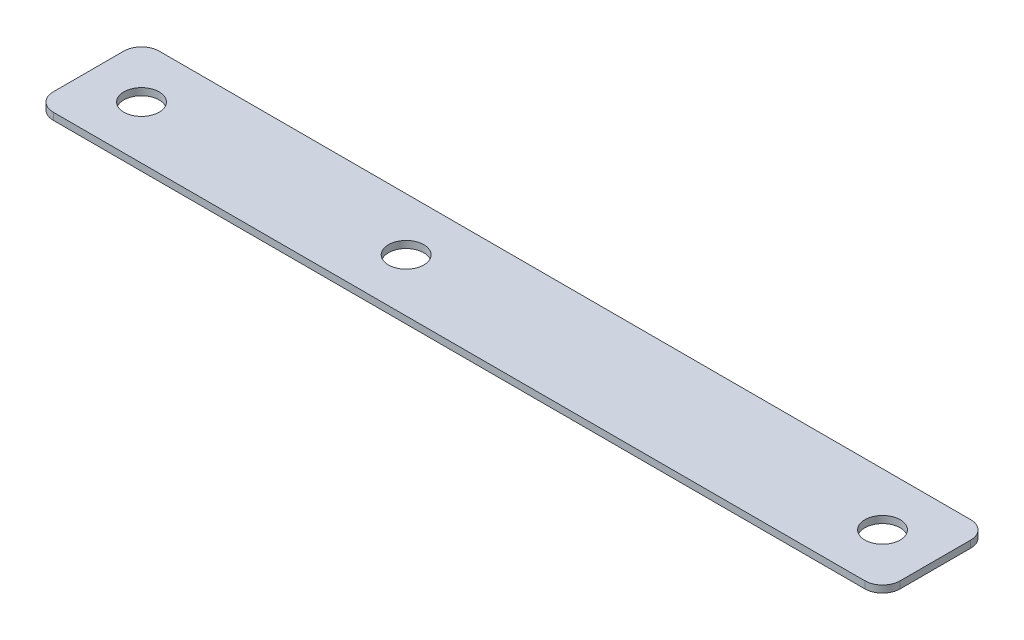
ISO-10303-21;
HEADER;
FILE_DESCRIPTION(('STEP AP214'),'2;1');
FILE_NAME('part.step','',(''),(''),'','','');
FILE_SCHEMA(('AUTOMOTIVE_DESIGN { 1 0 10303 214 1 1 1 1 }'));
ENDSEC;
DATA;
#1=APPLICATION_CONTEXT('core data for automotive mechanical design processes');
#2=APPLICATION_PROTOCOL_DEFINITION('international standard','automotive_design',2000,#1);
#3=PRODUCT_CONTEXT('',#1,'mechanical');
#4=PRODUCT('Part','Part','',(#3));
#5=PRODUCT_RELATED_PRODUCT_CATEGORY('part','',(#4));
#6=PRODUCT_DEFINITION_FORMATION('','',#4);
#7=PRODUCT_DEFINITION_CONTEXT('part definition',#1,'design');
#8=PRODUCT_DEFINITION('design','',#6,#7);
#9=PRODUCT_DEFINITION_SHAPE('','',#8);
#10=(LENGTH_UNIT() NAMED_UNIT(*) SI_UNIT(.MILLI.,.METRE.));
#11=(NAMED_UNIT(*) PLANE_ANGLE_UNIT() SI_UNIT($,.RADIAN.));
#12=(NAMED_UNIT(*) SI_UNIT($,.STERADIAN.) SOLID_ANGLE_UNIT());
#13=UNCERTAINTY_MEASURE_WITH_UNIT(LENGTH_MEASURE(1.E-05),#10,'distance_accuracy_value','');
#14=(GEOMETRIC_REPRESENTATION_CONTEXT(3) GLOBAL_UNCERTAINTY_ASSIGNED_CONTEXT((#13)) GLOBAL_UNIT_ASSIGNED_CONTEXT((#10,
#11,#12)) REPRESENTATION_CONTEXT('',''));
#15=CARTESIAN_POINT('',(0.,0.,0.));
#16=DIRECTION('',(0.,0.,1.));
#17=DIRECTION('',(1.,0.,0.));
#18=AXIS2_PLACEMENT_3D('',#15,#16,#17);
#19=CARTESIAN_POINT('',(298.45,2.54,-6.35));
#20=DIRECTION('',(0.,1.,0.));
#21=DIRECTION('',(0.,0.,1.));
#22=AXIS2_PLACEMENT_3D('',#19,#20,#21);
#23=PLANE('',#22);
#24=CARTESIAN_POINT('',(285.75,2.54,-19.05));
#25=DIRECTION('',(0.,1.,0.));
#26=DIRECTION('',(0.,0.,-1.));
#27=AXIS2_PLACEMENT_3D('',#24,#25,#26);
#28=CIRCLE('',#27,6.35);
#29=CARTESIAN_POINT('',(285.75,2.54,-25.4));
#30=VERTEX_POINT('',#29);
#31=EDGE_CURVE('E182',#30,#30,#28,.T.);
#32=ORIENTED_EDGE('',*,*,#31,.F.);
#33=EDGE_LOOP('',(#32));
#34=FACE_BOUND('',#33,.T.);
#35=CARTESIAN_POINT('',(298.45,2.54,-6.35));
#36=DIRECTION('',(0.,1.,0.));
#37=DIRECTION('',(0.,0.,1.));
#38=AXIS2_PLACEMENT_3D('',#35,#36,#37);
#39=CIRCLE('',#38,6.35000000000001);
#40=CARTESIAN_POINT('',(298.45,2.54,0.));
#41=VERTEX_POINT('',#40);
#42=CARTESIAN_POINT('',(304.8,2.54,-6.35000000000004));
#43=VERTEX_POINT('',#42);
#44=EDGE_CURVE('E145',#41,#43,#39,.T.);
#45=ORIENTED_EDGE('',*,*,#44,.T.);
#46=DIRECTION('',(0.,0.,-1.));
#47=VECTOR('',#46,1.);
#48=CARTESIAN_POINT('',(304.8,2.54,-6.35000000000004));
#49=LINE('',#48,#47);
#50=CARTESIAN_POINT('',(304.8,2.54,-31.75));
#51=VERTEX_POINT('',#50);
#52=EDGE_CURVE('E93',#43,#51,#49,.T.);
#53=ORIENTED_EDGE('',*,*,#52,.T.);
#54=CARTESIAN_POINT('',(298.45,2.54,-31.75));
#55=DIRECTION('',(0.,1.,0.));
#56=DIRECTION('',(0.,0.,-1.));
#57=AXIS2_PLACEMENT_3D('',#54,#55,#56);
#58=CIRCLE('',#57,6.35000000000001);
#59=CARTESIAN_POINT('',(298.45,2.54,-38.1));
#60=VERTEX_POINT('',#59);
#61=EDGE_CURVE('E160',#51,#60,#58,.T.);
#62=ORIENTED_EDGE('',*,*,#61,.T.);
#63=DIRECTION('',(-1.,0.,0.));
#64=VECTOR('',#63,1.);
#65=CARTESIAN_POINT('',(6.35000000000004,2.54,-38.1));
#66=LINE('',#65,#64);
#67=CARTESIAN_POINT('',(6.35,2.54,-38.1));
#68=VERTEX_POINT('',#67);
#69=EDGE_CURVE('E173',#60,#68,#66,.T.);
#70=ORIENTED_EDGE('',*,*,#69,.T.);
#71=CARTESIAN_POINT('',(6.35,2.54,-31.75));
#72=DIRECTION('',(0.,1.,0.));
#73=DIRECTION('',(0.,0.,-1.));
#74=AXIS2_PLACEMENT_3D('',#71,#72,#73);
#75=CIRCLE('',#74,6.35);
#76=CARTESIAN_POINT('',(0.,2.54,-31.75));
#77=VERTEX_POINT('',#76);
#78=EDGE_CURVE('E112',#68,#77,#75,.T.);
#79=ORIENTED_EDGE('',*,*,#78,.T.);
#80=DIRECTION('',(0.,0.,1.));
#81=VECTOR('',#80,1.);
#82=CARTESIAN_POINT('',(0.,2.54,-6.35000000000004));
#83=LINE('',#82,#81);
#84=CARTESIAN_POINT('',(0.,2.54,-6.35000000000004));
#85=VERTEX_POINT('',#84);
#86=EDGE_CURVE('E106',#77,#85,#83,.T.);
#87=ORIENTED_EDGE('',*,*,#86,.T.);
#88=CARTESIAN_POINT('',(6.35,2.54,-6.35));
#89=DIRECTION('',(0.,1.,0.));
#90=DIRECTION('',(0.,0.,-1.));
#91=AXIS2_PLACEMENT_3D('',#88,#89,#90);
#92=CIRCLE('',#91,6.35);
#93=CARTESIAN_POINT('',(6.35000000000004,2.54,0.));
#94=VERTEX_POINT('',#93);
#95=EDGE_CURVE('E110',#85,#94,#92,.T.);
#96=ORIENTED_EDGE('',*,*,#95,.T.);
#97=DIRECTION('',(1.,0.,0.));
#98=VECTOR('',#97,1.);
#99=CARTESIAN_POINT('',(6.35000000000004,2.54,0.));
#100=LINE('',#99,#98);
#101=EDGE_CURVE('E50',#94,#41,#100,.T.);
#102=ORIENTED_EDGE('',*,*,#101,.T.);
#103=EDGE_LOOP('',(#45,#53,#62,#70,#79,#87,#96,#102));
#104=FACE_BOUND('',#103,.T.);
#105=CARTESIAN_POINT('',(19.05,2.54,-19.05));
#106=DIRECTION('',(0.,1.,0.));
#107=DIRECTION('',(0.,0.,1.));
#108=AXIS2_PLACEMENT_3D('',#105,#106,#107);
#109=CIRCLE('',#108,6.35);
#110=CARTESIAN_POINT('',(19.05,2.54,-12.7));
#111=VERTEX_POINT('',#110);
#112=EDGE_CURVE('E134',#111,#111,#109,.T.);
#113=ORIENTED_EDGE('',*,*,#112,.F.);
#114=EDGE_LOOP('',(#113));
#115=FACE_BOUND('',#114,.T.);
#116=CARTESIAN_POINT('',(114.3,2.54,-19.05));
#117=DIRECTION('',(0.,1.,0.));
#118=DIRECTION('',(0.,0.,1.));
#119=AXIS2_PLACEMENT_3D('',#116,#117,#118);
#120=CIRCLE('',#119,6.35);
#121=CARTESIAN_POINT('',(114.3,2.54,-12.7));
#122=VERTEX_POINT('',#121);
#123=EDGE_CURVE('E188',#122,#122,#120,.T.);
#124=ORIENTED_EDGE('',*,*,#123,.F.);
#125=EDGE_LOOP('',(#124));
#126=FACE_BOUND('',#125,.T.);
#127=ADVANCED_FACE('F33',(#34,#104,#115,#126),#23,.T.);
#128=CARTESIAN_POINT('',(298.45,0.,-6.35));
#129=DIRECTION('',(0.,1.,0.));
#130=DIRECTION('',(0.,0.,1.));
#131=AXIS2_PLACEMENT_3D('',#128,#129,#130);
#132=PLANE('',#131);
#133=CARTESIAN_POINT('',(298.45,0.,-6.35));
#134=DIRECTION('',(0.,1.,0.));
#135=DIRECTION('',(0.,0.,1.));
#136=AXIS2_PLACEMENT_3D('',#133,#134,#135);
#137=CIRCLE('',#136,6.35000000000001);
#138=CARTESIAN_POINT('',(298.45,0.,0.));
#139=VERTEX_POINT('',#138);
#140=CARTESIAN_POINT('',(304.8,0.,-6.35000000000004));
#141=VERTEX_POINT('',#140);
#142=EDGE_CURVE('E130',#139,#141,#137,.T.);
#143=ORIENTED_EDGE('',*,*,#142,.F.);
#144=DIRECTION('',(1.,0.,0.));
#145=VECTOR('',#144,1.);
#146=CARTESIAN_POINT('',(6.35000000000004,0.,0.));
#147=LINE('',#146,#145);
#148=CARTESIAN_POINT('',(6.35000000000004,0.,0.));
#149=VERTEX_POINT('',#148);
#150=EDGE_CURVE('E85',#149,#139,#147,.T.);
#151=ORIENTED_EDGE('',*,*,#150,.F.);
#152=CARTESIAN_POINT('',(6.35,0.,-6.35));
#153=DIRECTION('',(0.,1.,0.));
#154=DIRECTION('',(0.,0.,-1.));
#155=AXIS2_PLACEMENT_3D('',#152,#153,#154);
#156=CIRCLE('',#155,6.35);
#157=CARTESIAN_POINT('',(0.,0.,-6.35000000000004));
#158=VERTEX_POINT('',#157);
#159=EDGE_CURVE('E79',#158,#149,#156,.T.);
#160=ORIENTED_EDGE('',*,*,#159,.F.);
#161=DIRECTION('',(0.,0.,1.));
#162=VECTOR('',#161,1.);
#163=CARTESIAN_POINT('',(0.,0.,-6.35000000000004));
#164=LINE('',#163,#162);
#165=CARTESIAN_POINT('',(0.,0.,-31.75));
#166=VERTEX_POINT('',#165);
#167=EDGE_CURVE('E120',#166,#158,#164,.T.);
#168=ORIENTED_EDGE('',*,*,#167,.F.);
#169=CARTESIAN_POINT('',(6.35,0.,-31.75));
#170=DIRECTION('',(0.,1.,0.));
#171=DIRECTION('',(0.,0.,-1.));
#172=AXIS2_PLACEMENT_3D('',#169,#170,#171);
#173=CIRCLE('',#172,6.35);
#174=CARTESIAN_POINT('',(6.35,0.,-38.1));
#175=VERTEX_POINT('',#174);
#176=EDGE_CURVE('E140',#175,#166,#173,.T.);
#177=ORIENTED_EDGE('',*,*,#176,.F.);
#178=DIRECTION('',(-1.,0.,0.));
#179=VECTOR('',#178,1.);
#180=CARTESIAN_POINT('',(6.35000000000004,0.,-38.1));
#181=LINE('',#180,#179);
#182=CARTESIAN_POINT('',(298.45,0.,-38.1));
#183=VERTEX_POINT('',#182);
#184=EDGE_CURVE('E138',#183,#175,#181,.T.);
#185=ORIENTED_EDGE('',*,*,#184,.F.);
#186=CARTESIAN_POINT('',(298.45,0.,-31.75));
#187=DIRECTION('',(0.,1.,0.));
#188=DIRECTION('',(0.,0.,-1.));
#189=AXIS2_PLACEMENT_3D('',#186,#187,#188);
#190=CIRCLE('',#189,6.35000000000001);
#191=CARTESIAN_POINT('',(304.8,0.,-31.75));
#192=VERTEX_POINT('',#191);
#193=EDGE_CURVE('E136',#192,#183,#190,.T.);
#194=ORIENTED_EDGE('',*,*,#193,.F.);
#195=DIRECTION('',(0.,0.,-1.));
#196=VECTOR('',#195,1.);
#197=CARTESIAN_POINT('',(304.8,0.,-6.35000000000004));
#198=LINE('',#197,#196);
#199=EDGE_CURVE('E133',#141,#192,#198,.T.);
#200=ORIENTED_EDGE('',*,*,#199,.F.);
#201=EDGE_LOOP('',(#143,#151,#160,#168,#177,#185,#194,#200));
#202=FACE_BOUND('',#201,.T.);
#203=CARTESIAN_POINT('',(19.05,0.,-19.05));
#204=DIRECTION('',(0.,1.,0.));
#205=DIRECTION('',(0.,0.,1.));
#206=AXIS2_PLACEMENT_3D('',#203,#204,#205);
#207=CIRCLE('',#206,6.35);
#208=CARTESIAN_POINT('',(19.05,0.,-12.7));
#209=VERTEX_POINT('',#208);
#210=EDGE_CURVE('E179',#209,#209,#207,.T.);
#211=ORIENTED_EDGE('',*,*,#210,.T.);
#212=EDGE_LOOP('',(#211));
#213=FACE_BOUND('',#212,.T.);
#214=CARTESIAN_POINT('',(285.75,0.,-19.05));
#215=DIRECTION('',(0.,1.,0.));
#216=DIRECTION('',(0.,0.,-1.));
#217=AXIS2_PLACEMENT_3D('',#214,#215,#216);
#218=CIRCLE('',#217,6.35);
#219=CARTESIAN_POINT('',(285.75,0.,-25.4));
#220=VERTEX_POINT('',#219);
#221=EDGE_CURVE('E185',#220,#220,#218,.T.);
#222=ORIENTED_EDGE('',*,*,#221,.T.);
#223=EDGE_LOOP('',(#222));
#224=FACE_BOUND('',#223,.T.);
#225=CARTESIAN_POINT('',(114.3,0.,-19.05));
#226=DIRECTION('',(0.,1.,0.));
#227=DIRECTION('',(0.,0.,1.));
#228=AXIS2_PLACEMENT_3D('',#225,#226,#227);
#229=CIRCLE('',#228,6.35);
#230=CARTESIAN_POINT('',(114.3,0.,-12.7));
#231=VERTEX_POINT('',#230);
#232=EDGE_CURVE('E191',#231,#231,#229,.T.);
#233=ORIENTED_EDGE('',*,*,#232,.T.);
#234=EDGE_LOOP('',(#233));
#235=FACE_BOUND('',#234,.T.);
#236=ADVANCED_FACE('F164',(#202,#213,#224,#235),#132,.F.);
#237=CARTESIAN_POINT('',(298.45,2.54,-6.35));
#238=DIRECTION('',(0.,-1.,0.));
#239=DIRECTION('',(0.,0.,-1.));
#240=AXIS2_PLACEMENT_3D('',#237,#238,#239);
#241=CYLINDRICAL_SURFACE('',#240,6.35000000000001);
#242=ORIENTED_EDGE('',*,*,#142,.T.);
#243=DIRECTION('',(0.,-1.,0.));
#244=VECTOR('',#243,1.);
#245=CARTESIAN_POINT('',(304.8,2.54,-6.35000000000004));
#246=LINE('',#245,#244);
#247=EDGE_CURVE('E11',#43,#141,#246,.T.);
#248=ORIENTED_EDGE('',*,*,#247,.F.);
#249=ORIENTED_EDGE('',*,*,#44,.F.);
#250=DIRECTION('',(0.,-1.,0.));
#251=VECTOR('',#250,1.);
#252=CARTESIAN_POINT('',(298.45,2.54,0.));
#253=LINE('',#252,#251);
#254=EDGE_CURVE('E126',#41,#139,#253,.T.);
#255=ORIENTED_EDGE('',*,*,#254,.T.);
#256=EDGE_LOOP('',(#242,#248,#249,#255));
#257=FACE_BOUND('',#256,.T.);
#258=ADVANCED_FACE('F35',(#257),#241,.T.);
#259=CARTESIAN_POINT('',(304.8,2.54,-6.35000000000004));
#260=DIRECTION('',(-1.,0.,0.));
#261=DIRECTION('',(0.,0.,1.));
#262=AXIS2_PLACEMENT_3D('',#259,#260,#261);
#263=PLANE('',#262);
#264=ORIENTED_EDGE('',*,*,#199,.T.);
#265=DIRECTION('',(0.,-1.,0.));
#266=VECTOR('',#265,1.);
#267=CARTESIAN_POINT('',(304.8,2.54,-31.75));
#268=LINE('',#267,#266);
#269=EDGE_CURVE('E42',#51,#192,#268,.T.);
#270=ORIENTED_EDGE('',*,*,#269,.F.);
#271=ORIENTED_EDGE('',*,*,#52,.F.);
#272=ORIENTED_EDGE('',*,*,#247,.T.);
#273=EDGE_LOOP('',(#264,#270,#271,#272));
#274=FACE_BOUND('',#273,.T.);
#275=ADVANCED_FACE('F224',(#274),#263,.F.);
#276=CARTESIAN_POINT('',(298.45,2.54,-31.75));
#277=DIRECTION('',(0.,-1.,0.));
#278=DIRECTION('',(0.,0.,-1.));
#279=AXIS2_PLACEMENT_3D('',#276,#277,#278);
#280=CYLINDRICAL_SURFACE('',#279,6.35000000000001);
#281=ORIENTED_EDGE('',*,*,#193,.T.);
#282=DIRECTION('',(0.,-1.,0.));
#283=VECTOR('',#282,1.);
#284=CARTESIAN_POINT('',(298.45,2.54,-38.1));
#285=LINE('',#284,#283);
#286=EDGE_CURVE('E152',#60,#183,#285,.T.);
#287=ORIENTED_EDGE('',*,*,#286,.F.);
#288=ORIENTED_EDGE('',*,*,#61,.F.);
#289=ORIENTED_EDGE('',*,*,#269,.T.);
#290=EDGE_LOOP('',(#281,#287,#288,#289));
#291=FACE_BOUND('',#290,.T.);
#292=ADVANCED_FACE('F158',(#291),#280,.T.);
#293=CARTESIAN_POINT('',(6.35000000000004,2.54,-38.1));
#294=DIRECTION('',(0.,0.,1.));
#295=DIRECTION('',(1.,0.,0.));
#296=AXIS2_PLACEMENT_3D('',#293,#294,#295);
#297=PLANE('',#296);
#298=ORIENTED_EDGE('',*,*,#184,.T.);
#299=DIRECTION('',(0.,-1.,0.));
#300=VECTOR('',#299,1.);
#301=CARTESIAN_POINT('',(6.35,2.54,-38.1));
#302=LINE('',#301,#300);
#303=EDGE_CURVE('E149',#68,#175,#302,.T.);
#304=ORIENTED_EDGE('',*,*,#303,.F.);
#305=ORIENTED_EDGE('',*,*,#69,.F.);
#306=ORIENTED_EDGE('',*,*,#286,.T.);
#307=EDGE_LOOP('',(#298,#304,#305,#306));
#308=FACE_BOUND('',#307,.T.);
#309=ADVANCED_FACE('F169',(#308),#297,.F.);
#310=CARTESIAN_POINT('',(6.35,2.54,-31.75));
#311=DIRECTION('',(0.,-1.,0.));
#312=DIRECTION('',(0.,0.,-1.));
#313=AXIS2_PLACEMENT_3D('',#310,#311,#312);
#314=CYLINDRICAL_SURFACE('',#313,6.35);
#315=ORIENTED_EDGE('',*,*,#176,.T.);
#316=DIRECTION('',(0.,-1.,0.));
#317=VECTOR('',#316,1.);
#318=CARTESIAN_POINT('',(0.,2.54,-31.75));
#319=LINE('',#318,#317);
#320=EDGE_CURVE('E121',#77,#166,#319,.T.);
#321=ORIENTED_EDGE('',*,*,#320,.F.);
#322=ORIENTED_EDGE('',*,*,#78,.F.);
#323=ORIENTED_EDGE('',*,*,#303,.T.);
#324=EDGE_LOOP('',(#315,#321,#322,#323));
#325=FACE_BOUND('',#324,.T.);
#326=ADVANCED_FACE('F172',(#325),#314,.T.);
#327=CARTESIAN_POINT('',(0.,2.54,-6.35000000000004));
#328=DIRECTION('',(1.,0.,0.));
#329=DIRECTION('',(0.,0.,-1.));
#330=AXIS2_PLACEMENT_3D('',#327,#328,#329);
#331=PLANE('',#330);
#332=ORIENTED_EDGE('',*,*,#167,.T.);
#333=DIRECTION('',(0.,-1.,0.));
#334=VECTOR('',#333,1.);
#335=CARTESIAN_POINT('',(0.,2.54,-6.35000000000004));
#336=LINE('',#335,#334);
#337=EDGE_CURVE('E117',#85,#158,#336,.T.);
#338=ORIENTED_EDGE('',*,*,#337,.F.);
#339=ORIENTED_EDGE('',*,*,#86,.F.);
#340=ORIENTED_EDGE('',*,*,#320,.T.);
#341=EDGE_LOOP('',(#332,#338,#339,#340));
#342=FACE_BOUND('',#341,.T.);
#343=ADVANCED_FACE('F118',(#342),#331,.F.);
#344=CARTESIAN_POINT('',(6.35,2.54,-6.35));
#345=DIRECTION('',(0.,-1.,0.));
#346=DIRECTION('',(0.,0.,-1.));
#347=AXIS2_PLACEMENT_3D('',#344,#345,#346);
#348=CYLINDRICAL_SURFACE('',#347,6.35);
#349=ORIENTED_EDGE('',*,*,#159,.T.);
#350=DIRECTION('',(0.,-1.,0.));
#351=VECTOR('',#350,1.);
#352=CARTESIAN_POINT('',(6.35000000000004,2.54,0.));
#353=LINE('',#352,#351);
#354=EDGE_CURVE('E122',#94,#149,#353,.T.);
#355=ORIENTED_EDGE('',*,*,#354,.F.);
#356=ORIENTED_EDGE('',*,*,#95,.F.);
#357=ORIENTED_EDGE('',*,*,#337,.T.);
#358=EDGE_LOOP('',(#349,#355,#356,#357));
#359=FACE_BOUND('',#358,.T.);
#360=ADVANCED_FACE('F124',(#359),#348,.T.);
#361=CARTESIAN_POINT('',(6.35000000000004,2.54,0.));
#362=DIRECTION('',(0.,0.,-1.));
#363=DIRECTION('',(-1.,0.,0.));
#364=AXIS2_PLACEMENT_3D('',#361,#362,#363);
#365=PLANE('',#364);
#366=ORIENTED_EDGE('',*,*,#150,.T.);
#367=ORIENTED_EDGE('',*,*,#254,.F.);
#368=ORIENTED_EDGE('',*,*,#101,.F.);
#369=ORIENTED_EDGE('',*,*,#354,.T.);
#370=EDGE_LOOP('',(#366,#367,#368,#369));
#371=FACE_BOUND('',#370,.T.);
#372=ADVANCED_FACE('F212',(#371),#365,.F.);
#373=CARTESIAN_POINT('',(19.05,2.54,-19.05));
#374=DIRECTION('',(0.,-1.,0.));
#375=DIRECTION('',(0.,0.,-1.));
#376=AXIS2_PLACEMENT_3D('',#373,#374,#375);
#377=CYLINDRICAL_SURFACE('',#376,6.35);
#378=ORIENTED_EDGE('',*,*,#112,.T.);
#379=EDGE_LOOP('',(#378));
#380=FACE_BOUND('',#379,.T.);
#381=ORIENTED_EDGE('',*,*,#210,.F.);
#382=EDGE_LOOP('',(#381));
#383=FACE_BOUND('',#382,.T.);
#384=ADVANCED_FACE('F209',(#380,#383),#377,.F.);
#385=CARTESIAN_POINT('',(285.75,2.54,-19.05));
#386=DIRECTION('',(0.,-1.,0.));
#387=DIRECTION('',(0.,0.,-1.));
#388=AXIS2_PLACEMENT_3D('',#385,#386,#387);
#389=CYLINDRICAL_SURFACE('',#388,6.35);
#390=ORIENTED_EDGE('',*,*,#31,.T.);
#391=EDGE_LOOP('',(#390));
#392=FACE_BOUND('',#391,.T.);
#393=ORIENTED_EDGE('',*,*,#221,.F.);
#394=EDGE_LOOP('',(#393));
#395=FACE_BOUND('',#394,.T.);
#396=ADVANCED_FACE('F288',(#392,#395),#389,.F.);
#397=CARTESIAN_POINT('',(114.3,2.54,-19.05));
#398=DIRECTION('',(0.,-1.,0.));
#399=DIRECTION('',(0.,0.,-1.));
#400=AXIS2_PLACEMENT_3D('',#397,#398,#399);
#401=CYLINDRICAL_SURFACE('',#400,6.35);
#402=ORIENTED_EDGE('',*,*,#123,.T.);
#403=EDGE_LOOP('',(#402));
#404=FACE_BOUND('',#403,.T.);
#405=ORIENTED_EDGE('',*,*,#232,.F.);
#406=EDGE_LOOP('',(#405));
#407=FACE_BOUND('',#406,.T.);
#408=ADVANCED_FACE('F197',(#404,#407),#401,.F.);
#409=CLOSED_SHELL('',(#127,#236,#258,#275,#292,#309,#326,#343,#360,#372,#384,#396,#408));
#410=MANIFOLD_SOLID_BREP('B2',#409);
#411=ADVANCED_BREP_SHAPE_REPRESENTATION('',(#18,#410),#14);
#412=SHAPE_DEFINITION_REPRESENTATION(#9,#411);
ENDSEC;
END-ISO-10303-21;
